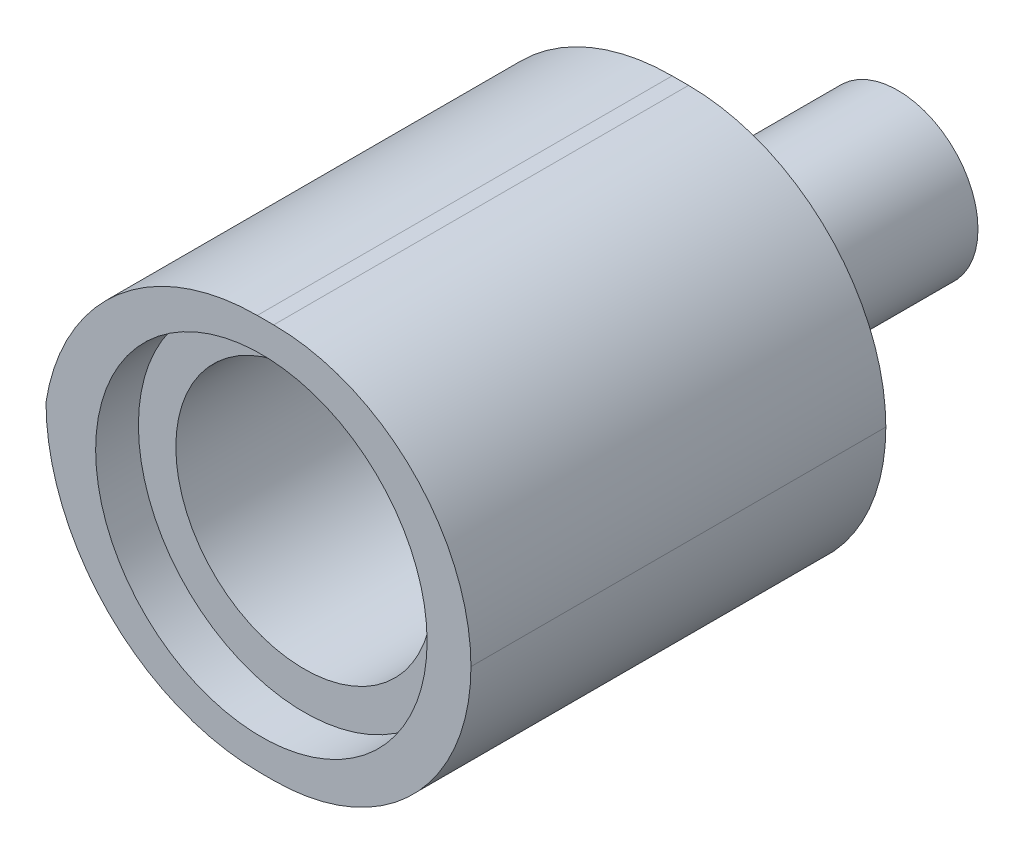
ISO-10303-21;
HEADER;
FILE_DESCRIPTION(('STEP AP214'),'2;1');
FILE_NAME('part.step','',(''),(''),'','','');
FILE_SCHEMA(('AUTOMOTIVE_DESIGN { 1 0 10303 214 1 1 1 1 }'));
ENDSEC;
DATA;
#1=APPLICATION_CONTEXT('core data for automotive mechanical design processes');
#2=APPLICATION_PROTOCOL_DEFINITION('international standard','automotive_design',2000,#1);
#3=PRODUCT_CONTEXT('',#1,'mechanical');
#4=PRODUCT('Part','Part','',(#3));
#5=PRODUCT_RELATED_PRODUCT_CATEGORY('part','',(#4));
#6=PRODUCT_DEFINITION_FORMATION('','',#4);
#7=PRODUCT_DEFINITION_CONTEXT('part definition',#1,'design');
#8=PRODUCT_DEFINITION('design','',#6,#7);
#9=PRODUCT_DEFINITION_SHAPE('','',#8);
#10=(LENGTH_UNIT() NAMED_UNIT(*) SI_UNIT(.MILLI.,.METRE.));
#11=(NAMED_UNIT(*) PLANE_ANGLE_UNIT() SI_UNIT($,.RADIAN.));
#12=(NAMED_UNIT(*) SI_UNIT($,.STERADIAN.) SOLID_ANGLE_UNIT());
#13=UNCERTAINTY_MEASURE_WITH_UNIT(LENGTH_MEASURE(1.E-05),#10,'distance_accuracy_value','');
#14=(GEOMETRIC_REPRESENTATION_CONTEXT(3) GLOBAL_UNCERTAINTY_ASSIGNED_CONTEXT((#13)) GLOBAL_UNIT_ASSIGNED_CONTEXT((#10,
#11,#12)) REPRESENTATION_CONTEXT('',''));
#15=CARTESIAN_POINT('',(0.,0.,0.));
#16=DIRECTION('',(0.,0.,1.));
#17=DIRECTION('',(1.,0.,0.));
#18=AXIS2_PLACEMENT_3D('',#15,#16,#17);
#19=CARTESIAN_POINT('',(3.50482412281685,5.98077243718547,0.842275333902865));
#20=DIRECTION('',(0.,0.,-1.));
#21=DIRECTION('',(-1.,0.,0.));
#22=AXIS2_PLACEMENT_3D('',#19,#20,#21);
#23=CYLINDRICAL_SURFACE('',#22,1.5);
#24=CARTESIAN_POINT('',(3.50482412281685,5.98077243718547,0.842275333902865));
#25=DIRECTION('',(0.,0.,1.));
#26=DIRECTION('',(1.,0.,0.));
#27=AXIS2_PLACEMENT_3D('',#24,#25,#26);
#28=CIRCLE('',#27,1.5);
#29=CARTESIAN_POINT('',(5.00482412281685,5.98077243718547,0.842275333902865));
#30=VERTEX_POINT('',#29);
#31=EDGE_CURVE('P0_E9',#30,#30,#28,.T.);
#32=ORIENTED_EDGE('',*,*,#31,.F.);
#33=EDGE_LOOP('',(#32));
#34=FACE_BOUND('',#33,.T.);
#35=CARTESIAN_POINT('',(3.50482412281685,5.98077243718547,-3.15772466609714));
#36=DIRECTION('',(0.,0.,1.));
#37=DIRECTION('',(1.,0.,0.));
#38=AXIS2_PLACEMENT_3D('',#35,#36,#37);
#39=CIRCLE('',#38,1.5);
#40=CARTESIAN_POINT('',(5.00482412281685,5.98077243718547,-3.15772466609714));
#41=VERTEX_POINT('',#40);
#42=EDGE_CURVE('P0_E17',#41,#41,#39,.T.);
#43=ORIENTED_EDGE('',*,*,#42,.T.);
#44=EDGE_LOOP('',(#43));
#45=FACE_BOUND('',#44,.T.);
#46=ADVANCED_FACE('P0_F14',(#34,#45),#23,.T.);
#47=CARTESIAN_POINT('',(3.50482412281685,5.98077243718547,0.842275333902865));
#48=DIRECTION('',(0.,0.,1.));
#49=DIRECTION('',(1.,0.,0.));
#50=AXIS2_PLACEMENT_3D('',#47,#48,#49);
#51=PLANE('',#50);
#52=ORIENTED_EDGE('',*,*,#31,.T.);
#53=EDGE_LOOP('',(#52));
#54=FACE_BOUND('',#53,.T.);
#55=ADVANCED_FACE('P0_F29',(#54),#51,.T.);
#56=CARTESIAN_POINT('',(3.50482412281685,5.98077243718547,-3.15772466609714));
#57=DIRECTION('',(0.,0.,1.));
#58=DIRECTION('',(1.,0.,0.));
#59=AXIS2_PLACEMENT_3D('',#56,#57,#58);
#60=PLANE('',#59);
#61=ORIENTED_EDGE('',*,*,#42,.F.);
#62=EDGE_LOOP('',(#61));
#63=FACE_BOUND('',#62,.T.);
#64=ADVANCED_FACE('P0_F27',(#63),#60,.F.);
#65=CLOSED_SHELL('',(#46,#55,#64));
#66=MANIFOLD_SOLID_BREP('P0_B1',#65);
#67=CARTESIAN_POINT('',(3.59090329672629,5.91333400718236,8.60227533390286));
#68=DIRECTION('',(0.,0.,1.));
#69=DIRECTION('',(1.,0.,0.));
#70=AXIS2_PLACEMENT_3D('',#67,#68,#69);
#71=CYLINDRICAL_SURFACE('',#70,3.69);
#72=DIRECTION('',(0.,0.,1.));
#73=VECTOR('',#72,1.);
#74=CARTESIAN_POINT('',(3.59090329672629,2.22333400718236,8.60227533390286));
#75=LINE('',#74,#73);
#76=CARTESIAN_POINT('',(3.59090329672629,2.22333400718236,0.842275333902865));
#77=VERTEX_POINT('',#76);
#78=CARTESIAN_POINT('',(3.59090329672629,2.22333400718236,8.60227533390286));
#79=VERTEX_POINT('',#78);
#80=EDGE_CURVE('P1_E76',#77,#79,#75,.T.);
#81=ORIENTED_EDGE('',*,*,#80,.F.);
#82=CARTESIAN_POINT('',(3.59090329672629,5.91333400718236,0.842275333902865));
#83=DIRECTION('',(0.,0.,-1.));
#84=DIRECTION('',(-1.,0.,0.));
#85=AXIS2_PLACEMENT_3D('',#82,#83,#84);
#86=CIRCLE('',#85,3.69);
#87=CARTESIAN_POINT('',(7.28090329672629,5.91333400718236,0.842275333902865));
#88=VERTEX_POINT('',#87);
#89=EDGE_CURVE('P1_E70',#88,#77,#86,.T.);
#90=ORIENTED_EDGE('',*,*,#89,.F.);
#91=DIRECTION('',(0.,0.,1.));
#92=VECTOR('',#91,1.);
#93=CARTESIAN_POINT('',(7.28090329672629,5.91333400718236,8.60227533390286));
#94=LINE('',#93,#92);
#95=CARTESIAN_POINT('',(7.28090329672629,5.91333400718236,8.60227533390286));
#96=VERTEX_POINT('',#95);
#97=EDGE_CURVE('P1_E74',#88,#96,#94,.T.);
#98=ORIENTED_EDGE('',*,*,#97,.T.);
#99=CARTESIAN_POINT('',(3.59090329672629,5.91333400718236,8.60227533390286));
#100=DIRECTION('',(0.,0.,-1.));
#101=DIRECTION('',(-1.,0.,0.));
#102=AXIS2_PLACEMENT_3D('',#99,#100,#101);
#103=CIRCLE('',#102,3.69);
#104=EDGE_CURVE('P1_E78',#79,#96,#103,.F.);
#105=ORIENTED_EDGE('',*,*,#104,.F.);
#106=EDGE_LOOP('',(#81,#90,#98,#105));
#107=FACE_BOUND('',#106,.T.);
#108=ADVANCED_FACE('P1_F17',(#107),#71,.T.);
#109=CARTESIAN_POINT('',(3.59090329672629,5.91333400718236,8.60227533390286));
#110=DIRECTION('',(0.,0.,1.));
#111=DIRECTION('',(1.,0.,0.));
#112=AXIS2_PLACEMENT_3D('',#109,#110,#111);
#113=CYLINDRICAL_SURFACE('',#112,3.69);
#114=ORIENTED_EDGE('',*,*,#97,.F.);
#115=CARTESIAN_POINT('',(3.59090329672629,5.91333400718236,0.842275333902865));
#116=DIRECTION('',(0.,0.,-1.));
#117=DIRECTION('',(-1.,0.,0.));
#118=AXIS2_PLACEMENT_3D('',#115,#116,#117);
#119=CIRCLE('',#118,3.69);
#120=CARTESIAN_POINT('',(3.59090329672628,9.60333400718236,0.842275333902865));
#121=VERTEX_POINT('',#120);
#122=EDGE_CURVE('P1_E80',#121,#88,#119,.T.);
#123=ORIENTED_EDGE('',*,*,#122,.F.);
#124=DIRECTION('',(0.,0.,1.));
#125=VECTOR('',#124,1.);
#126=CARTESIAN_POINT('',(3.59090329672629,9.60333400718236,8.60227533390286));
#127=LINE('',#126,#125);
#128=CARTESIAN_POINT('',(3.59090329672628,9.60333400718236,8.60227533390286));
#129=VERTEX_POINT('',#128);
#130=EDGE_CURVE('P1_E87',#129,#121,#127,.F.);
#131=ORIENTED_EDGE('',*,*,#130,.F.);
#132=CARTESIAN_POINT('',(3.59090329672629,5.91333400718236,8.60227533390286));
#133=DIRECTION('',(0.,0.,-1.));
#134=DIRECTION('',(-1.,0.,0.));
#135=AXIS2_PLACEMENT_3D('',#132,#133,#134);
#136=CIRCLE('',#135,3.69);
#137=EDGE_CURVE('P1_E86',#96,#129,#136,.F.);
#138=ORIENTED_EDGE('',*,*,#137,.F.);
#139=EDGE_LOOP('',(#114,#123,#131,#138));
#140=FACE_BOUND('',#139,.T.);
#141=ADVANCED_FACE('P1_F90',(#140),#113,.T.);
#142=CARTESIAN_POINT('',(-16.1390967032737,2.22333400718236,7.80227533390286));
#143=DIRECTION('',(0.,0.,-1.));
#144=DIRECTION('',(-1.,0.,0.));
#145=AXIS2_PLACEMENT_3D('',#142,#143,#144);
#146=PLANE('',#145);
#147=CARTESIAN_POINT('',(3.36090329672629,5.91333400718236,7.80227533390286));
#148=DIRECTION('',(0.,0.,1.));
#149=DIRECTION('',(1.,0.,0.));
#150=AXIS2_PLACEMENT_3D('',#147,#148,#149);
#151=CIRCLE('',#150,3.1);
#152=CARTESIAN_POINT('',(6.46090329672629,5.91333400718236,7.80227533390286));
#153=VERTEX_POINT('',#152);
#154=EDGE_CURVE('P1_E91',#153,#153,#151,.T.);
#155=ORIENTED_EDGE('',*,*,#154,.T.);
#156=EDGE_LOOP('',(#155));
#157=FACE_BOUND('',#156,.T.);
#158=CARTESIAN_POINT('',(3.36090329672629,5.91333400718236,7.80227533390286));
#159=DIRECTION('',(0.,0.,-1.));
#160=DIRECTION('',(-1.,0.,0.));
#161=AXIS2_PLACEMENT_3D('',#158,#159,#160);
#162=CIRCLE('',#161,2.4);
#163=CARTESIAN_POINT('',(0.960903296726287,5.91333400718236,7.80227533390286));
#164=VERTEX_POINT('',#163);
#165=EDGE_CURVE('P1_E133',#164,#164,#162,.F.);
#166=ORIENTED_EDGE('',*,*,#165,.F.);
#167=EDGE_LOOP('',(#166));
#168=FACE_BOUND('',#167,.T.);
#169=ADVANCED_FACE('P1_F157',(#157,#168),#146,.F.);
#170=CARTESIAN_POINT('',(3.36090329672629,5.91333400718236,8.60227533390286));
#171=DIRECTION('',(0.,0.,-1.));
#172=DIRECTION('',(-1.,0.,0.));
#173=AXIS2_PLACEMENT_3D('',#170,#171,#172);
#174=CYLINDRICAL_SURFACE('',#173,3.1);
#175=CARTESIAN_POINT('',(3.36090329672629,5.91333400718236,8.60227533390286));
#176=DIRECTION('',(0.,0.,1.));
#177=DIRECTION('',(1.,0.,0.));
#178=AXIS2_PLACEMENT_3D('',#175,#176,#177);
#179=CIRCLE('',#178,3.1);
#180=CARTESIAN_POINT('',(6.46090329672629,5.91333400718236,8.60227533390286));
#181=VERTEX_POINT('',#180);
#182=EDGE_CURVE('P1_E95',#181,#181,#179,.T.);
#183=ORIENTED_EDGE('',*,*,#182,.T.);
#184=EDGE_LOOP('',(#183));
#185=FACE_BOUND('',#184,.T.);
#186=ORIENTED_EDGE('',*,*,#154,.F.);
#187=EDGE_LOOP('',(#186));
#188=FACE_BOUND('',#187,.T.);
#189=ADVANCED_FACE('P1_F138',(#185,#188),#174,.F.);
#190=CARTESIAN_POINT('',(3.36090329672629,5.91333400718236,0.842275333902865));
#191=DIRECTION('',(0.,0.,1.));
#192=DIRECTION('',(1.,0.,0.));
#193=AXIS2_PLACEMENT_3D('',#190,#191,#192);
#194=CYLINDRICAL_SURFACE('',#193,2.4);
#195=ORIENTED_EDGE('',*,*,#165,.T.);
#196=EDGE_LOOP('',(#195));
#197=FACE_BOUND('',#196,.T.);
#198=CARTESIAN_POINT('',(3.36090329672629,5.91333400718236,1.64227533390286));
#199=DIRECTION('',(0.,0.,-1.));
#200=DIRECTION('',(-1.,0.,0.));
#201=AXIS2_PLACEMENT_3D('',#198,#199,#200);
#202=CIRCLE('',#201,2.4);
#203=CARTESIAN_POINT('',(0.960903296726287,5.91333400718236,1.64227533390286));
#204=VERTEX_POINT('',#203);
#205=EDGE_CURVE('P1_E129',#204,#204,#202,.F.);
#206=ORIENTED_EDGE('',*,*,#205,.F.);
#207=EDGE_LOOP('',(#206));
#208=FACE_BOUND('',#207,.T.);
#209=ADVANCED_FACE('P1_F175',(#197,#208),#194,.F.);
#210=CARTESIAN_POINT('',(-31.7190967032737,2.22333400718236,8.60227533390286));
#211=DIRECTION('',(0.,1.,0.));
#212=DIRECTION('',(0.,0.,1.));
#213=AXIS2_PLACEMENT_3D('',#210,#211,#212);
#214=PLANE('',#213);
#215=DIRECTION('',(1.,0.,0.));
#216=VECTOR('',#215,1.);
#217=CARTESIAN_POINT('',(-31.7190967032737,2.22333400718236,8.60227533390286));
#218=LINE('',#217,#216);
#219=CARTESIAN_POINT('',(3.33256779426839,2.22333400718236,8.60227533390286));
#220=VERTEX_POINT('',#219);
#221=EDGE_CURVE('P1_E125',#220,#79,#218,.T.);
#222=ORIENTED_EDGE('',*,*,#221,.F.);
#223=DIRECTION('',(0.,0.,-1.));
#224=VECTOR('',#223,1.);
#225=CARTESIAN_POINT('',(3.33256779426839,2.22333400718236,8.60227533390286));
#226=LINE('',#225,#224);
#227=CARTESIAN_POINT('',(3.33256779426839,2.22333400718236,0.842275333902865));
#228=VERTEX_POINT('',#227);
#229=EDGE_CURVE('P1_E102',#220,#228,#226,.T.);
#230=ORIENTED_EDGE('',*,*,#229,.T.);
#231=DIRECTION('',(1.,0.,0.));
#232=VECTOR('',#231,1.);
#233=CARTESIAN_POINT('',(-31.7190967032737,2.22333400718236,0.842275333902865));
#234=LINE('',#233,#232);
#235=EDGE_CURVE('P1_E126',#228,#77,#234,.T.);
#236=ORIENTED_EDGE('',*,*,#235,.T.);
#237=ORIENTED_EDGE('',*,*,#80,.T.);
#238=EDGE_LOOP('',(#222,#230,#236,#237));
#239=FACE_BOUND('',#238,.T.);
#240=ADVANCED_FACE('P1_F149',(#239),#214,.F.);
#241=CARTESIAN_POINT('',(-31.7190967032737,9.60333400718236,8.60227533390286));
#242=DIRECTION('',(0.,-1.,0.));
#243=DIRECTION('',(0.,0.,-1.));
#244=AXIS2_PLACEMENT_3D('',#241,#242,#243);
#245=PLANE('',#244);
#246=DIRECTION('',(-1.,0.,0.));
#247=VECTOR('',#246,1.);
#248=CARTESIAN_POINT('',(-31.7190967032737,9.60333400718236,0.842275333902865));
#249=LINE('',#248,#247);
#250=CARTESIAN_POINT('',(3.28422567419676,9.60333400718236,0.842275333902865));
#251=VERTEX_POINT('',#250);
#252=EDGE_CURVE('P1_E82',#121,#251,#249,.T.);
#253=ORIENTED_EDGE('',*,*,#252,.T.);
#254=DIRECTION('',(0.,0.,-1.));
#255=VECTOR('',#254,1.);
#256=CARTESIAN_POINT('',(3.28422567419676,9.60333400718236,8.60227533390286));
#257=LINE('',#256,#255);
#258=CARTESIAN_POINT('',(3.28422567419676,9.60333400718236,8.60227533390286));
#259=VERTEX_POINT('',#258);
#260=EDGE_CURVE('P1_E111',#251,#259,#257,.F.);
#261=ORIENTED_EDGE('',*,*,#260,.T.);
#262=DIRECTION('',(-1.,0.,0.));
#263=VECTOR('',#262,1.);
#264=CARTESIAN_POINT('',(-31.7190967032737,9.60333400718236,8.60227533390286));
#265=LINE('',#264,#263);
#266=EDGE_CURVE('P1_E118',#129,#259,#265,.T.);
#267=ORIENTED_EDGE('',*,*,#266,.F.);
#268=ORIENTED_EDGE('',*,*,#130,.T.);
#269=EDGE_LOOP('',(#253,#261,#267,#268));
#270=FACE_BOUND('',#269,.T.);
#271=ADVANCED_FACE('P1_F124',(#270),#245,.F.);
#272=CARTESIAN_POINT('',(-31.7190967032737,2.22333400718236,8.60227533390286));
#273=DIRECTION('',(0.,0.,-1.));
#274=DIRECTION('',(-1.,0.,0.));
#275=AXIS2_PLACEMENT_3D('',#272,#273,#274);
#276=PLANE('',#275);
#277=ORIENTED_EDGE('',*,*,#182,.F.);
#278=EDGE_LOOP('',(#277));
#279=FACE_BOUND('',#278,.T.);
#280=ORIENTED_EDGE('',*,*,#266,.T.);
#281=CARTESIAN_POINT('',(3.28422567419676,5.60333400718236,8.60227533390286));
#282=DIRECTION('',(0.,0.,-1.));
#283=DIRECTION('',(-1.,0.,0.));
#284=AXIS2_PLACEMENT_3D('',#281,#282,#283);
#285=CIRCLE('',#284,4.);
#286=CARTESIAN_POINT('',(-0.667432205731608,6.22333400718236,8.60227533390286));
#287=VERTEX_POINT('',#286);
#288=EDGE_CURVE('P1_E25',#259,#287,#285,.F.);
#289=ORIENTED_EDGE('',*,*,#288,.T.);
#290=CARTESIAN_POINT('',(3.33256779426839,6.22333400718236,8.60227533390286));
#291=DIRECTION('',(0.,0.,-1.));
#292=DIRECTION('',(-1.,0.,0.));
#293=AXIS2_PLACEMENT_3D('',#290,#291,#292);
#294=CIRCLE('',#293,4.);
#295=EDGE_CURVE('P1_E109',#287,#220,#294,.F.);
#296=ORIENTED_EDGE('',*,*,#295,.T.);
#297=ORIENTED_EDGE('',*,*,#221,.T.);
#298=ORIENTED_EDGE('',*,*,#104,.T.);
#299=ORIENTED_EDGE('',*,*,#137,.T.);
#300=EDGE_LOOP('',(#280,#289,#296,#297,#298,#299));
#301=FACE_BOUND('',#300,.T.);
#302=ADVANCED_FACE('P1_F115',(#279,#301),#276,.F.);
#303=CARTESIAN_POINT('',(-31.7190967032737,2.22333400718236,0.842275333902865));
#304=DIRECTION('',(0.,0.,-1.));
#305=DIRECTION('',(-1.,0.,0.));
#306=AXIS2_PLACEMENT_3D('',#303,#304,#305);
#307=PLANE('',#306);
#308=CARTESIAN_POINT('',(3.33256779426839,6.22333400718236,0.842275333902865));
#309=DIRECTION('',(0.,0.,-1.));
#310=DIRECTION('',(-1.,0.,0.));
#311=AXIS2_PLACEMENT_3D('',#308,#309,#310);
#312=CIRCLE('',#311,4.);
#313=CARTESIAN_POINT('',(-0.667432205731608,6.22333400718236,0.842275333902865));
#314=VERTEX_POINT('',#313);
#315=EDGE_CURVE('P1_E105',#228,#314,#312,.T.);
#316=ORIENTED_EDGE('',*,*,#315,.T.);
#317=CARTESIAN_POINT('',(3.28422567419676,5.60333400718236,0.842275333902865));
#318=DIRECTION('',(0.,0.,-1.));
#319=DIRECTION('',(-1.,0.,0.));
#320=AXIS2_PLACEMENT_3D('',#317,#318,#319);
#321=CIRCLE('',#320,4.);
#322=EDGE_CURVE('P1_E11',#314,#251,#321,.T.);
#323=ORIENTED_EDGE('',*,*,#322,.T.);
#324=ORIENTED_EDGE('',*,*,#252,.F.);
#325=ORIENTED_EDGE('',*,*,#122,.T.);
#326=ORIENTED_EDGE('',*,*,#89,.T.);
#327=ORIENTED_EDGE('',*,*,#235,.F.);
#328=EDGE_LOOP('',(#316,#323,#324,#325,#326,#327));
#329=FACE_BOUND('',#328,.T.);
#330=ADVANCED_FACE('P1_F81',(#329),#307,.T.);
#331=CARTESIAN_POINT('',(3.33256779426839,6.22333400718236,8.60227533390286));
#332=DIRECTION('',(0.,0.,-1.));
#333=DIRECTION('',(-1.,0.,0.));
#334=AXIS2_PLACEMENT_3D('',#331,#332,#333);
#335=CYLINDRICAL_SURFACE('',#334,4.);
#336=ORIENTED_EDGE('',*,*,#295,.F.);
#337=DIRECTION('',(0.,0.,-1.));
#338=VECTOR('',#337,1.);
#339=CARTESIAN_POINT('',(-0.667432205731608,6.22333400718236,10.8422753339029));
#340=LINE('',#339,#338);
#341=EDGE_CURVE('P1_E107',#314,#287,#340,.F.);
#342=ORIENTED_EDGE('',*,*,#341,.F.);
#343=ORIENTED_EDGE('',*,*,#315,.F.);
#344=ORIENTED_EDGE('',*,*,#229,.F.);
#345=EDGE_LOOP('',(#336,#342,#343,#344));
#346=FACE_BOUND('',#345,.T.);
#347=ADVANCED_FACE('P1_F122',(#346),#335,.T.);
#348=CARTESIAN_POINT('',(3.28422567419676,5.60333400718236,10.8422753339029));
#349=DIRECTION('',(0.,0.,-1.));
#350=DIRECTION('',(-1.,0.,0.));
#351=AXIS2_PLACEMENT_3D('',#348,#349,#350);
#352=CYLINDRICAL_SURFACE('',#351,4.);
#353=ORIENTED_EDGE('',*,*,#322,.F.);
#354=ORIENTED_EDGE('',*,*,#341,.T.);
#355=ORIENTED_EDGE('',*,*,#288,.F.);
#356=ORIENTED_EDGE('',*,*,#260,.F.);
#357=EDGE_LOOP('',(#353,#354,#355,#356));
#358=FACE_BOUND('',#357,.T.);
#359=ADVANCED_FACE('P1_F19',(#358),#352,.T.);
#360=CARTESIAN_POINT('',(-31.7190967032737,2.22333400718236,1.64227533390286));
#361=DIRECTION('',(0.,0.,-1.));
#362=DIRECTION('',(-1.,0.,0.));
#363=AXIS2_PLACEMENT_3D('',#360,#361,#362);
#364=PLANE('',#363);
#365=ORIENTED_EDGE('',*,*,#205,.T.);
#366=EDGE_LOOP('',(#365));
#367=FACE_BOUND('',#366,.T.);
#368=ADVANCED_FACE('P1_F164',(#367),#364,.F.);
#369=CLOSED_SHELL('',(#108,#141,#169,#189,#209,#240,#271,#302,#330,#347,#359,#368));
#370=MANIFOLD_SOLID_BREP('P1_B1',#369);
#371=ADVANCED_BREP_SHAPE_REPRESENTATION('',(#18,#66,#370),#14);
#372=SHAPE_DEFINITION_REPRESENTATION(#9,#371);
ENDSEC;
END-ISO-10303-21;
